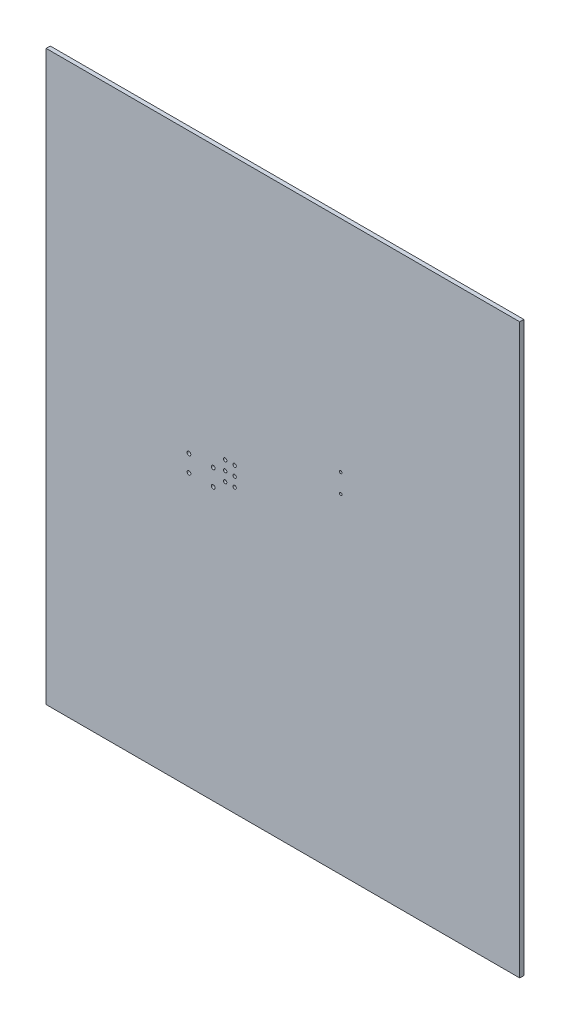
ISO-10303-21;
HEADER;
FILE_DESCRIPTION(('STEP AP214'),'2;1');
FILE_NAME('part.step','',(''),(''),'','','');
FILE_SCHEMA(('AUTOMOTIVE_DESIGN { 1 0 10303 214 1 1 1 1 }'));
ENDSEC;
DATA;
#1=APPLICATION_CONTEXT('core data for automotive mechanical design processes');
#2=APPLICATION_PROTOCOL_DEFINITION('international standard','automotive_design',2000,#1);
#3=PRODUCT_CONTEXT('',#1,'mechanical');
#4=PRODUCT('Part','Part','',(#3));
#5=PRODUCT_RELATED_PRODUCT_CATEGORY('part','',(#4));
#6=PRODUCT_DEFINITION_FORMATION('','',#4);
#7=PRODUCT_DEFINITION_CONTEXT('part definition',#1,'design');
#8=PRODUCT_DEFINITION('design','',#6,#7);
#9=PRODUCT_DEFINITION_SHAPE('','',#8);
#10=(LENGTH_UNIT() NAMED_UNIT(*) SI_UNIT(.MILLI.,.METRE.));
#11=(NAMED_UNIT(*) PLANE_ANGLE_UNIT() SI_UNIT($,.RADIAN.));
#12=(NAMED_UNIT(*) SI_UNIT($,.STERADIAN.) SOLID_ANGLE_UNIT());
#13=UNCERTAINTY_MEASURE_WITH_UNIT(LENGTH_MEASURE(1.E-05),#10,'distance_accuracy_value','');
#14=(GEOMETRIC_REPRESENTATION_CONTEXT(3) GLOBAL_UNCERTAINTY_ASSIGNED_CONTEXT((#13)) GLOBAL_UNIT_ASSIGNED_CONTEXT((#10,
#11,#12)) REPRESENTATION_CONTEXT('',''));
#15=CARTESIAN_POINT('',(0.,0.,0.));
#16=DIRECTION('',(0.,0.,1.));
#17=DIRECTION('',(1.,0.,0.));
#18=AXIS2_PLACEMENT_3D('',#15,#16,#17);
#19=CARTESIAN_POINT('',(25.4,25.4,1.10236));
#20=DIRECTION('',(0.,0.,1.));
#21=DIRECTION('',(1.,0.,0.));
#22=AXIS2_PLACEMENT_3D('',#19,#20,#21);
#23=PLANE('',#22);
#24=CARTESIAN_POINT('',(104.394,118.872,1.10236));
#25=DIRECTION('',(0.,0.,-1.));
#26=DIRECTION('',(-1.,0.,0.));
#27=AXIS2_PLACEMENT_3D('',#24,#25,#26);
#28=CIRCLE('',#27,0.3499993);
#29=CARTESIAN_POINT('',(104.0440007,118.872,1.10236));
#30=VERTEX_POINT('',#29);
#31=EDGE_CURVE('E116',#30,#30,#28,.T.);
#32=ORIENTED_EDGE('',*,*,#31,.T.);
#33=EDGE_LOOP('',(#32));
#34=FACE_BOUND('',#33,.T.);
#35=CARTESIAN_POINT('',(104.394,113.792,1.10236));
#36=DIRECTION('',(0.,0.,-1.));
#37=DIRECTION('',(-1.,0.,0.));
#38=AXIS2_PLACEMENT_3D('',#35,#36,#37);
#39=CIRCLE('',#38,0.3499993);
#40=CARTESIAN_POINT('',(104.0440007,113.792,1.10236));
#41=VERTEX_POINT('',#40);
#42=EDGE_CURVE('E119',#41,#41,#39,.T.);
#43=ORIENTED_EDGE('',*,*,#42,.T.);
#44=EDGE_LOOP('',(#43));
#45=FACE_BOUND('',#44,.T.);
#46=CARTESIAN_POINT('',(75.946,106.25020152,1.10236));
#47=DIRECTION('',(0.,0.,-1.));
#48=DIRECTION('',(-1.,0.,0.));
#49=AXIS2_PLACEMENT_3D('',#46,#47,#48);
#50=CIRCLE('',#49,0.4499991);
#51=CARTESIAN_POINT('',(75.4960009,106.25020152,1.10236));
#52=VERTEX_POINT('',#51);
#53=EDGE_CURVE('E122',#52,#52,#50,.T.);
#54=ORIENTED_EDGE('',*,*,#53,.T.);
#55=EDGE_LOOP('',(#54));
#56=FACE_BOUND('',#55,.T.);
#57=CARTESIAN_POINT('',(75.946,103.71020152,1.10236));
#58=DIRECTION('',(0.,0.,-1.));
#59=DIRECTION('',(-1.,0.,0.));
#60=AXIS2_PLACEMENT_3D('',#57,#58,#59);
#61=CIRCLE('',#60,0.4499991);
#62=CARTESIAN_POINT('',(75.4960009,103.71020152,1.10236));
#63=VERTEX_POINT('',#62);
#64=EDGE_CURVE('E125',#63,#63,#61,.T.);
#65=ORIENTED_EDGE('',*,*,#64,.T.);
#66=EDGE_LOOP('',(#65));
#67=FACE_BOUND('',#66,.T.);
#68=CARTESIAN_POINT('',(75.946,101.17020152,1.10236));
#69=DIRECTION('',(0.,0.,-1.));
#70=DIRECTION('',(-1.,0.,0.));
#71=AXIS2_PLACEMENT_3D('',#68,#69,#70);
#72=CIRCLE('',#71,0.4499991);
#73=CARTESIAN_POINT('',(75.4960009,101.17020152,1.10236));
#74=VERTEX_POINT('',#73);
#75=EDGE_CURVE('E128',#74,#74,#72,.T.);
#76=ORIENTED_EDGE('',*,*,#75,.T.);
#77=EDGE_LOOP('',(#76));
#78=FACE_BOUND('',#77,.T.);
#79=CARTESIAN_POINT('',(73.406,101.17020152,1.10236));
#80=DIRECTION('',(0.,0.,-1.));
#81=DIRECTION('',(-1.,0.,0.));
#82=AXIS2_PLACEMENT_3D('',#79,#80,#81);
#83=CIRCLE('',#82,0.4499991);
#84=CARTESIAN_POINT('',(72.9560009,101.17020152,1.10236));
#85=VERTEX_POINT('',#84);
#86=EDGE_CURVE('E131',#85,#85,#83,.T.);
#87=ORIENTED_EDGE('',*,*,#86,.T.);
#88=EDGE_LOOP('',(#87));
#89=FACE_BOUND('',#88,.T.);
#90=CARTESIAN_POINT('',(73.406,106.25020152,1.10236));
#91=DIRECTION('',(0.,0.,-1.));
#92=DIRECTION('',(-1.,0.,0.));
#93=AXIS2_PLACEMENT_3D('',#90,#91,#92);
#94=CIRCLE('',#93,0.4499991);
#95=CARTESIAN_POINT('',(72.9560009,106.25020152,1.10236));
#96=VERTEX_POINT('',#95);
#97=EDGE_CURVE('E134',#96,#96,#94,.T.);
#98=ORIENTED_EDGE('',*,*,#97,.T.);
#99=EDGE_LOOP('',(#98));
#100=FACE_BOUND('',#99,.T.);
#101=CARTESIAN_POINT('',(73.406,103.71020152,1.10236));
#102=DIRECTION('',(0.,0.,-1.));
#103=DIRECTION('',(-1.,0.,0.));
#104=AXIS2_PLACEMENT_3D('',#101,#102,#103);
#105=CIRCLE('',#104,0.4499991);
#106=CARTESIAN_POINT('',(72.9560009,103.71020152,1.10236));
#107=VERTEX_POINT('',#106);
#108=EDGE_CURVE('E137',#107,#107,#105,.T.);
#109=ORIENTED_EDGE('',*,*,#108,.T.);
#110=EDGE_LOOP('',(#109));
#111=FACE_BOUND('',#110,.T.);
#112=CARTESIAN_POINT('',(70.20440112,102.85940058,1.10236));
#113=DIRECTION('',(0.,0.,-1.));
#114=DIRECTION('',(-1.,0.,0.));
#115=AXIS2_PLACEMENT_3D('',#112,#113,#114);
#116=CIRCLE('',#115,0.499999);
#117=CARTESIAN_POINT('',(69.70440212,102.85940058,1.10236));
#118=VERTEX_POINT('',#117);
#119=EDGE_CURVE('E140',#118,#118,#116,.T.);
#120=ORIENTED_EDGE('',*,*,#119,.T.);
#121=EDGE_LOOP('',(#120));
#122=FACE_BOUND('',#121,.T.);
#123=CARTESIAN_POINT('',(63.70439888,98.35939942,1.10236));
#124=DIRECTION('',(0.,0.,-1.));
#125=DIRECTION('',(-1.,0.,0.));
#126=AXIS2_PLACEMENT_3D('',#123,#124,#125);
#127=CIRCLE('',#126,0.499999);
#128=CARTESIAN_POINT('',(63.20439988,98.35939942,1.10236));
#129=VERTEX_POINT('',#128);
#130=EDGE_CURVE('E143',#129,#129,#127,.T.);
#131=ORIENTED_EDGE('',*,*,#130,.T.);
#132=EDGE_LOOP('',(#131));
#133=FACE_BOUND('',#132,.T.);
#134=CARTESIAN_POINT('',(70.20440112,98.35939942,1.10236));
#135=DIRECTION('',(0.,0.,-1.));
#136=DIRECTION('',(-1.,0.,0.));
#137=AXIS2_PLACEMENT_3D('',#134,#135,#136);
#138=CIRCLE('',#137,0.499999);
#139=CARTESIAN_POINT('',(69.70440212,98.35939942,1.10236));
#140=VERTEX_POINT('',#139);
#141=EDGE_CURVE('E145',#140,#140,#138,.T.);
#142=ORIENTED_EDGE('',*,*,#141,.T.);
#143=EDGE_LOOP('',(#142));
#144=FACE_BOUND('',#143,.T.);
#145=CARTESIAN_POINT('',(63.70439888,102.85940058,1.10236));
#146=DIRECTION('',(0.,0.,-1.));
#147=DIRECTION('',(-1.,0.,0.));
#148=AXIS2_PLACEMENT_3D('',#145,#146,#147);
#149=CIRCLE('',#148,0.499999);
#150=CARTESIAN_POINT('',(63.20439988,102.85940058,1.10236));
#151=VERTEX_POINT('',#150);
#152=EDGE_CURVE('E20',#151,#151,#149,.T.);
#153=ORIENTED_EDGE('',*,*,#152,.T.);
#154=EDGE_LOOP('',(#153));
#155=FACE_BOUND('',#154,.T.);
#156=DIRECTION('',(1.,0.,0.));
#157=VECTOR('',#156,1.);
#158=CARTESIAN_POINT('',(25.4,177.8,1.10236));
#159=LINE('',#158,#157);
#160=CARTESIAN_POINT('',(25.4,177.8,1.10236));
#161=VERTEX_POINT('',#160);
#162=CARTESIAN_POINT('',(152.4,177.8,1.10236));
#163=VERTEX_POINT('',#162);
#164=EDGE_CURVE('E54',#161,#163,#159,.T.);
#165=ORIENTED_EDGE('',*,*,#164,.F.);
#166=DIRECTION('',(0.,1.,0.));
#167=VECTOR('',#166,1.);
#168=CARTESIAN_POINT('',(25.4,25.4,1.10236));
#169=LINE('',#168,#167);
#170=CARTESIAN_POINT('',(25.4,25.4,1.10236));
#171=VERTEX_POINT('',#170);
#172=EDGE_CURVE('E71',#171,#161,#169,.T.);
#173=ORIENTED_EDGE('',*,*,#172,.F.);
#174=DIRECTION('',(1.,0.,0.));
#175=VECTOR('',#174,1.);
#176=CARTESIAN_POINT('',(152.4,25.4,1.10236));
#177=LINE('',#176,#175);
#178=CARTESIAN_POINT('',(152.4,25.4,1.10236));
#179=VERTEX_POINT('',#178);
#180=EDGE_CURVE('E68',#179,#171,#177,.F.);
#181=ORIENTED_EDGE('',*,*,#180,.F.);
#182=DIRECTION('',(0.,1.,0.));
#183=VECTOR('',#182,1.);
#184=CARTESIAN_POINT('',(152.4,177.8,1.10236));
#185=LINE('',#184,#183);
#186=EDGE_CURVE('E59',#163,#179,#185,.F.);
#187=ORIENTED_EDGE('',*,*,#186,.F.);
#188=EDGE_LOOP('',(#165,#173,#181,#187));
#189=FACE_BOUND('',#188,.T.);
#190=ADVANCED_FACE('F17',(#34,#45,#56,#67,#78,#89,#100,#111,#122,#133,#144,#155,#189),#23,.T.);
#191=CARTESIAN_POINT('',(152.4,25.4,0.));
#192=DIRECTION('',(0.,-1.,0.));
#193=DIRECTION('',(0.,0.,-1.));
#194=AXIS2_PLACEMENT_3D('',#191,#192,#193);
#195=PLANE('',#194);
#196=DIRECTION('',(0.,0.,1.));
#197=VECTOR('',#196,1.);
#198=CARTESIAN_POINT('',(25.4,25.4,0.));
#199=LINE('',#198,#197);
#200=CARTESIAN_POINT('',(25.4,25.4,0.));
#201=VERTEX_POINT('',#200);
#202=EDGE_CURVE('E153',#201,#171,#199,.T.);
#203=ORIENTED_EDGE('',*,*,#202,.F.);
#204=DIRECTION('',(1.,0.,0.));
#205=VECTOR('',#204,1.);
#206=CARTESIAN_POINT('',(25.4,25.4,0.));
#207=LINE('',#206,#205);
#208=CARTESIAN_POINT('',(152.4,25.4,0.));
#209=VERTEX_POINT('',#208);
#210=EDGE_CURVE('E78',#201,#209,#207,.T.);
#211=ORIENTED_EDGE('',*,*,#210,.T.);
#212=DIRECTION('',(0.,0.,-1.));
#213=VECTOR('',#212,1.);
#214=CARTESIAN_POINT('',(152.4,25.4,0.));
#215=LINE('',#214,#213);
#216=EDGE_CURVE('E64',#179,#209,#215,.T.);
#217=ORIENTED_EDGE('',*,*,#216,.F.);
#218=ORIENTED_EDGE('',*,*,#180,.T.);
#219=EDGE_LOOP('',(#203,#211,#217,#218));
#220=FACE_BOUND('',#219,.T.);
#221=ADVANCED_FACE('F77',(#220),#195,.T.);
#222=CARTESIAN_POINT('',(152.4,177.8,0.));
#223=DIRECTION('',(1.,0.,0.));
#224=DIRECTION('',(0.,0.,-1.));
#225=AXIS2_PLACEMENT_3D('',#222,#223,#224);
#226=PLANE('',#225);
#227=ORIENTED_EDGE('',*,*,#216,.T.);
#228=DIRECTION('',(0.,1.,0.));
#229=VECTOR('',#228,1.);
#230=CARTESIAN_POINT('',(152.4,25.4,0.));
#231=LINE('',#230,#229);
#232=CARTESIAN_POINT('',(152.4,177.8,0.));
#233=VERTEX_POINT('',#232);
#234=EDGE_CURVE('E164',#209,#233,#231,.T.);
#235=ORIENTED_EDGE('',*,*,#234,.T.);
#236=DIRECTION('',(0.,0.,1.));
#237=VECTOR('',#236,1.);
#238=CARTESIAN_POINT('',(152.4,177.8,0.));
#239=LINE('',#238,#237);
#240=EDGE_CURVE('E66',#163,#233,#239,.F.);
#241=ORIENTED_EDGE('',*,*,#240,.F.);
#242=ORIENTED_EDGE('',*,*,#186,.T.);
#243=EDGE_LOOP('',(#227,#235,#241,#242));
#244=FACE_BOUND('',#243,.T.);
#245=ADVANCED_FACE('F61',(#244),#226,.T.);
#246=CARTESIAN_POINT('',(25.4,177.8,0.));
#247=DIRECTION('',(0.,1.,0.));
#248=DIRECTION('',(0.,0.,1.));
#249=AXIS2_PLACEMENT_3D('',#246,#247,#248);
#250=PLANE('',#249);
#251=ORIENTED_EDGE('',*,*,#240,.T.);
#252=DIRECTION('',(1.,0.,0.));
#253=VECTOR('',#252,1.);
#254=CARTESIAN_POINT('',(25.4,177.8,0.));
#255=LINE('',#254,#253);
#256=CARTESIAN_POINT('',(25.4,177.8,0.));
#257=VERTEX_POINT('',#256);
#258=EDGE_CURVE('E161',#233,#257,#255,.F.);
#259=ORIENTED_EDGE('',*,*,#258,.T.);
#260=DIRECTION('',(0.,0.,1.));
#261=VECTOR('',#260,1.);
#262=CARTESIAN_POINT('',(25.4,177.8,0.));
#263=LINE('',#262,#261);
#264=EDGE_CURVE('E35',#161,#257,#263,.F.);
#265=ORIENTED_EDGE('',*,*,#264,.F.);
#266=ORIENTED_EDGE('',*,*,#164,.T.);
#267=EDGE_LOOP('',(#251,#259,#265,#266));
#268=FACE_BOUND('',#267,.T.);
#269=ADVANCED_FACE('F160',(#268),#250,.T.);
#270=CARTESIAN_POINT('',(25.4,25.4,0.));
#271=DIRECTION('',(-1.,0.,0.));
#272=DIRECTION('',(0.,0.,1.));
#273=AXIS2_PLACEMENT_3D('',#270,#271,#272);
#274=PLANE('',#273);
#275=ORIENTED_EDGE('',*,*,#264,.T.);
#276=DIRECTION('',(0.,1.,0.));
#277=VECTOR('',#276,1.);
#278=CARTESIAN_POINT('',(25.4,25.4,0.));
#279=LINE('',#278,#277);
#280=EDGE_CURVE('E115',#257,#201,#279,.F.);
#281=ORIENTED_EDGE('',*,*,#280,.T.);
#282=ORIENTED_EDGE('',*,*,#202,.T.);
#283=ORIENTED_EDGE('',*,*,#172,.T.);
#284=EDGE_LOOP('',(#275,#281,#282,#283));
#285=FACE_BOUND('',#284,.T.);
#286=ADVANCED_FACE('F167',(#285),#274,.T.);
#287=CARTESIAN_POINT('',(63.70439888,102.85940058,0.));
#288=DIRECTION('',(0.,0.,-1.));
#289=DIRECTION('',(-1.,0.,0.));
#290=AXIS2_PLACEMENT_3D('',#287,#288,#289);
#291=CYLINDRICAL_SURFACE('',#290,0.499999);
#292=ORIENTED_EDGE('',*,*,#152,.F.);
#293=EDGE_LOOP('',(#292));
#294=FACE_BOUND('',#293,.T.);
#295=CARTESIAN_POINT('',(63.70439888,102.85940058,0.));
#296=DIRECTION('',(0.,0.,-1.));
#297=DIRECTION('',(-1.,0.,0.));
#298=AXIS2_PLACEMENT_3D('',#295,#296,#297);
#299=CIRCLE('',#298,0.499999);
#300=CARTESIAN_POINT('',(63.20439988,102.85940058,0.));
#301=VERTEX_POINT('',#300);
#302=EDGE_CURVE('E112',#301,#301,#299,.F.);
#303=ORIENTED_EDGE('',*,*,#302,.F.);
#304=EDGE_LOOP('',(#303));
#305=FACE_BOUND('',#304,.T.);
#306=ADVANCED_FACE('F169',(#294,#305),#291,.F.);
#307=CARTESIAN_POINT('',(70.20440112,98.35939942,0.));
#308=DIRECTION('',(0.,0.,-1.));
#309=DIRECTION('',(-1.,0.,0.));
#310=AXIS2_PLACEMENT_3D('',#307,#308,#309);
#311=CYLINDRICAL_SURFACE('',#310,0.499999);
#312=ORIENTED_EDGE('',*,*,#141,.F.);
#313=EDGE_LOOP('',(#312));
#314=FACE_BOUND('',#313,.T.);
#315=CARTESIAN_POINT('',(70.20440112,98.35939942,0.));
#316=DIRECTION('',(0.,0.,-1.));
#317=DIRECTION('',(-1.,0.,0.));
#318=AXIS2_PLACEMENT_3D('',#315,#316,#317);
#319=CIRCLE('',#318,0.499999);
#320=CARTESIAN_POINT('',(69.70440212,98.35939942,0.));
#321=VERTEX_POINT('',#320);
#322=EDGE_CURVE('E109',#321,#321,#319,.F.);
#323=ORIENTED_EDGE('',*,*,#322,.F.);
#324=EDGE_LOOP('',(#323));
#325=FACE_BOUND('',#324,.T.);
#326=ADVANCED_FACE('F176',(#314,#325),#311,.F.);
#327=CARTESIAN_POINT('',(63.70439888,98.35939942,0.));
#328=DIRECTION('',(0.,0.,-1.));
#329=DIRECTION('',(-1.,0.,0.));
#330=AXIS2_PLACEMENT_3D('',#327,#328,#329);
#331=CYLINDRICAL_SURFACE('',#330,0.499999);
#332=ORIENTED_EDGE('',*,*,#130,.F.);
#333=EDGE_LOOP('',(#332));
#334=FACE_BOUND('',#333,.T.);
#335=CARTESIAN_POINT('',(63.70439888,98.35939942,0.));
#336=DIRECTION('',(0.,0.,-1.));
#337=DIRECTION('',(-1.,0.,0.));
#338=AXIS2_PLACEMENT_3D('',#335,#336,#337);
#339=CIRCLE('',#338,0.499999);
#340=CARTESIAN_POINT('',(63.20439988,98.35939942,0.));
#341=VERTEX_POINT('',#340);
#342=EDGE_CURVE('E106',#341,#341,#339,.F.);
#343=ORIENTED_EDGE('',*,*,#342,.F.);
#344=EDGE_LOOP('',(#343));
#345=FACE_BOUND('',#344,.T.);
#346=ADVANCED_FACE('F222',(#334,#345),#331,.F.);
#347=CARTESIAN_POINT('',(70.20440112,102.85940058,0.));
#348=DIRECTION('',(0.,0.,-1.));
#349=DIRECTION('',(-1.,0.,0.));
#350=AXIS2_PLACEMENT_3D('',#347,#348,#349);
#351=CYLINDRICAL_SURFACE('',#350,0.499999);
#352=ORIENTED_EDGE('',*,*,#119,.F.);
#353=EDGE_LOOP('',(#352));
#354=FACE_BOUND('',#353,.T.);
#355=CARTESIAN_POINT('',(70.20440112,102.85940058,0.));
#356=DIRECTION('',(0.,0.,-1.));
#357=DIRECTION('',(-1.,0.,0.));
#358=AXIS2_PLACEMENT_3D('',#355,#356,#357);
#359=CIRCLE('',#358,0.499999);
#360=CARTESIAN_POINT('',(69.70440212,102.85940058,0.));
#361=VERTEX_POINT('',#360);
#362=EDGE_CURVE('E103',#361,#361,#359,.F.);
#363=ORIENTED_EDGE('',*,*,#362,.F.);
#364=EDGE_LOOP('',(#363));
#365=FACE_BOUND('',#364,.T.);
#366=ADVANCED_FACE('F218',(#354,#365),#351,.F.);
#367=CARTESIAN_POINT('',(73.406,103.71020152,0.));
#368=DIRECTION('',(0.,0.,-1.));
#369=DIRECTION('',(-1.,0.,0.));
#370=AXIS2_PLACEMENT_3D('',#367,#368,#369);
#371=CYLINDRICAL_SURFACE('',#370,0.4499991);
#372=ORIENTED_EDGE('',*,*,#108,.F.);
#373=EDGE_LOOP('',(#372));
#374=FACE_BOUND('',#373,.T.);
#375=CARTESIAN_POINT('',(73.406,103.71020152,0.));
#376=DIRECTION('',(0.,0.,-1.));
#377=DIRECTION('',(-1.,0.,0.));
#378=AXIS2_PLACEMENT_3D('',#375,#376,#377);
#379=CIRCLE('',#378,0.4499991);
#380=CARTESIAN_POINT('',(72.9560009,103.71020152,0.));
#381=VERTEX_POINT('',#380);
#382=EDGE_CURVE('E100',#381,#381,#379,.F.);
#383=ORIENTED_EDGE('',*,*,#382,.F.);
#384=EDGE_LOOP('',(#383));
#385=FACE_BOUND('',#384,.T.);
#386=ADVANCED_FACE('F214',(#374,#385),#371,.F.);
#387=CARTESIAN_POINT('',(73.406,106.25020152,0.));
#388=DIRECTION('',(0.,0.,-1.));
#389=DIRECTION('',(-1.,0.,0.));
#390=AXIS2_PLACEMENT_3D('',#387,#388,#389);
#391=CYLINDRICAL_SURFACE('',#390,0.4499991);
#392=ORIENTED_EDGE('',*,*,#97,.F.);
#393=EDGE_LOOP('',(#392));
#394=FACE_BOUND('',#393,.T.);
#395=CARTESIAN_POINT('',(73.406,106.25020152,0.));
#396=DIRECTION('',(0.,0.,-1.));
#397=DIRECTION('',(-1.,0.,0.));
#398=AXIS2_PLACEMENT_3D('',#395,#396,#397);
#399=CIRCLE('',#398,0.4499991);
#400=CARTESIAN_POINT('',(72.9560009,106.25020152,0.));
#401=VERTEX_POINT('',#400);
#402=EDGE_CURVE('E97',#401,#401,#399,.F.);
#403=ORIENTED_EDGE('',*,*,#402,.F.);
#404=EDGE_LOOP('',(#403));
#405=FACE_BOUND('',#404,.T.);
#406=ADVANCED_FACE('F210',(#394,#405),#391,.F.);
#407=CARTESIAN_POINT('',(73.406,101.17020152,0.));
#408=DIRECTION('',(0.,0.,-1.));
#409=DIRECTION('',(-1.,0.,0.));
#410=AXIS2_PLACEMENT_3D('',#407,#408,#409);
#411=CYLINDRICAL_SURFACE('',#410,0.4499991);
#412=ORIENTED_EDGE('',*,*,#86,.F.);
#413=EDGE_LOOP('',(#412));
#414=FACE_BOUND('',#413,.T.);
#415=CARTESIAN_POINT('',(73.406,101.17020152,0.));
#416=DIRECTION('',(0.,0.,-1.));
#417=DIRECTION('',(-1.,0.,0.));
#418=AXIS2_PLACEMENT_3D('',#415,#416,#417);
#419=CIRCLE('',#418,0.4499991);
#420=CARTESIAN_POINT('',(72.9560009,101.17020152,0.));
#421=VERTEX_POINT('',#420);
#422=EDGE_CURVE('E94',#421,#421,#419,.F.);
#423=ORIENTED_EDGE('',*,*,#422,.F.);
#424=EDGE_LOOP('',(#423));
#425=FACE_BOUND('',#424,.T.);
#426=ADVANCED_FACE('F206',(#414,#425),#411,.F.);
#427=CARTESIAN_POINT('',(75.946,101.17020152,0.));
#428=DIRECTION('',(0.,0.,-1.));
#429=DIRECTION('',(-1.,0.,0.));
#430=AXIS2_PLACEMENT_3D('',#427,#428,#429);
#431=CYLINDRICAL_SURFACE('',#430,0.4499991);
#432=ORIENTED_EDGE('',*,*,#75,.F.);
#433=EDGE_LOOP('',(#432));
#434=FACE_BOUND('',#433,.T.);
#435=CARTESIAN_POINT('',(75.946,101.17020152,0.));
#436=DIRECTION('',(0.,0.,-1.));
#437=DIRECTION('',(-1.,0.,0.));
#438=AXIS2_PLACEMENT_3D('',#435,#436,#437);
#439=CIRCLE('',#438,0.4499991);
#440=CARTESIAN_POINT('',(75.4960009,101.17020152,0.));
#441=VERTEX_POINT('',#440);
#442=EDGE_CURVE('E91',#441,#441,#439,.F.);
#443=ORIENTED_EDGE('',*,*,#442,.F.);
#444=EDGE_LOOP('',(#443));
#445=FACE_BOUND('',#444,.T.);
#446=ADVANCED_FACE('F202',(#434,#445),#431,.F.);
#447=CARTESIAN_POINT('',(75.946,103.71020152,0.));
#448=DIRECTION('',(0.,0.,-1.));
#449=DIRECTION('',(-1.,0.,0.));
#450=AXIS2_PLACEMENT_3D('',#447,#448,#449);
#451=CYLINDRICAL_SURFACE('',#450,0.4499991);
#452=ORIENTED_EDGE('',*,*,#64,.F.);
#453=EDGE_LOOP('',(#452));
#454=FACE_BOUND('',#453,.T.);
#455=CARTESIAN_POINT('',(75.946,103.71020152,0.));
#456=DIRECTION('',(0.,0.,-1.));
#457=DIRECTION('',(-1.,0.,0.));
#458=AXIS2_PLACEMENT_3D('',#455,#456,#457);
#459=CIRCLE('',#458,0.4499991);
#460=CARTESIAN_POINT('',(75.4960009,103.71020152,0.));
#461=VERTEX_POINT('',#460);
#462=EDGE_CURVE('E88',#461,#461,#459,.F.);
#463=ORIENTED_EDGE('',*,*,#462,.F.);
#464=EDGE_LOOP('',(#463));
#465=FACE_BOUND('',#464,.T.);
#466=ADVANCED_FACE('F198',(#454,#465),#451,.F.);
#467=CARTESIAN_POINT('',(75.946,106.25020152,0.));
#468=DIRECTION('',(0.,0.,-1.));
#469=DIRECTION('',(-1.,0.,0.));
#470=AXIS2_PLACEMENT_3D('',#467,#468,#469);
#471=CYLINDRICAL_SURFACE('',#470,0.4499991);
#472=ORIENTED_EDGE('',*,*,#53,.F.);
#473=EDGE_LOOP('',(#472));
#474=FACE_BOUND('',#473,.T.);
#475=CARTESIAN_POINT('',(75.946,106.25020152,0.));
#476=DIRECTION('',(0.,0.,-1.));
#477=DIRECTION('',(-1.,0.,0.));
#478=AXIS2_PLACEMENT_3D('',#475,#476,#477);
#479=CIRCLE('',#478,0.4499991);
#480=CARTESIAN_POINT('',(75.4960009,106.25020152,0.));
#481=VERTEX_POINT('',#480);
#482=EDGE_CURVE('E85',#481,#481,#479,.F.);
#483=ORIENTED_EDGE('',*,*,#482,.F.);
#484=EDGE_LOOP('',(#483));
#485=FACE_BOUND('',#484,.T.);
#486=ADVANCED_FACE('F194',(#474,#485),#471,.F.);
#487=CARTESIAN_POINT('',(104.394,113.792,0.));
#488=DIRECTION('',(0.,0.,-1.));
#489=DIRECTION('',(-1.,0.,0.));
#490=AXIS2_PLACEMENT_3D('',#487,#488,#489);
#491=CYLINDRICAL_SURFACE('',#490,0.3499993);
#492=ORIENTED_EDGE('',*,*,#42,.F.);
#493=EDGE_LOOP('',(#492));
#494=FACE_BOUND('',#493,.T.);
#495=CARTESIAN_POINT('',(104.394,113.792,0.));
#496=DIRECTION('',(0.,0.,-1.));
#497=DIRECTION('',(-1.,0.,0.));
#498=AXIS2_PLACEMENT_3D('',#495,#496,#497);
#499=CIRCLE('',#498,0.3499993);
#500=CARTESIAN_POINT('',(104.0440007,113.792,0.));
#501=VERTEX_POINT('',#500);
#502=EDGE_CURVE('E26',#501,#501,#499,.F.);
#503=ORIENTED_EDGE('',*,*,#502,.F.);
#504=EDGE_LOOP('',(#503));
#505=FACE_BOUND('',#504,.T.);
#506=ADVANCED_FACE('F187',(#494,#505),#491,.F.);
#507=CARTESIAN_POINT('',(104.394,118.872,0.));
#508=DIRECTION('',(0.,0.,-1.));
#509=DIRECTION('',(-1.,0.,0.));
#510=AXIS2_PLACEMENT_3D('',#507,#508,#509);
#511=CYLINDRICAL_SURFACE('',#510,0.3499993);
#512=ORIENTED_EDGE('',*,*,#31,.F.);
#513=EDGE_LOOP('',(#512));
#514=FACE_BOUND('',#513,.T.);
#515=CARTESIAN_POINT('',(104.394,118.872,0.));
#516=DIRECTION('',(0.,0.,-1.));
#517=DIRECTION('',(-1.,0.,0.));
#518=AXIS2_PLACEMENT_3D('',#515,#516,#517);
#519=CIRCLE('',#518,0.3499993);
#520=CARTESIAN_POINT('',(104.0440007,118.872,0.));
#521=VERTEX_POINT('',#520);
#522=EDGE_CURVE('E11',#521,#521,#519,.F.);
#523=ORIENTED_EDGE('',*,*,#522,.F.);
#524=EDGE_LOOP('',(#523));
#525=FACE_BOUND('',#524,.T.);
#526=ADVANCED_FACE('F181',(#514,#525),#511,.F.);
#527=CARTESIAN_POINT('',(25.4,25.4,0.));
#528=DIRECTION('',(0.,0.,1.));
#529=DIRECTION('',(1.,0.,0.));
#530=AXIS2_PLACEMENT_3D('',#527,#528,#529);
#531=PLANE('',#530);
#532=ORIENTED_EDGE('',*,*,#522,.T.);
#533=EDGE_LOOP('',(#532));
#534=FACE_BOUND('',#533,.T.);
#535=ORIENTED_EDGE('',*,*,#502,.T.);
#536=EDGE_LOOP('',(#535));
#537=FACE_BOUND('',#536,.T.);
#538=ORIENTED_EDGE('',*,*,#482,.T.);
#539=EDGE_LOOP('',(#538));
#540=FACE_BOUND('',#539,.T.);
#541=ORIENTED_EDGE('',*,*,#462,.T.);
#542=EDGE_LOOP('',(#541));
#543=FACE_BOUND('',#542,.T.);
#544=ORIENTED_EDGE('',*,*,#442,.T.);
#545=EDGE_LOOP('',(#544));
#546=FACE_BOUND('',#545,.T.);
#547=ORIENTED_EDGE('',*,*,#422,.T.);
#548=EDGE_LOOP('',(#547));
#549=FACE_BOUND('',#548,.T.);
#550=ORIENTED_EDGE('',*,*,#402,.T.);
#551=EDGE_LOOP('',(#550));
#552=FACE_BOUND('',#551,.T.);
#553=ORIENTED_EDGE('',*,*,#382,.T.);
#554=EDGE_LOOP('',(#553));
#555=FACE_BOUND('',#554,.T.);
#556=ORIENTED_EDGE('',*,*,#362,.T.);
#557=EDGE_LOOP('',(#556));
#558=FACE_BOUND('',#557,.T.);
#559=ORIENTED_EDGE('',*,*,#342,.T.);
#560=EDGE_LOOP('',(#559));
#561=FACE_BOUND('',#560,.T.);
#562=ORIENTED_EDGE('',*,*,#322,.T.);
#563=EDGE_LOOP('',(#562));
#564=FACE_BOUND('',#563,.T.);
#565=ORIENTED_EDGE('',*,*,#302,.T.);
#566=EDGE_LOOP('',(#565));
#567=FACE_BOUND('',#566,.T.);
#568=ORIENTED_EDGE('',*,*,#258,.F.);
#569=ORIENTED_EDGE('',*,*,#234,.F.);
#570=ORIENTED_EDGE('',*,*,#210,.F.);
#571=ORIENTED_EDGE('',*,*,#280,.F.);
#572=EDGE_LOOP('',(#568,#569,#570,#571));
#573=FACE_BOUND('',#572,.T.);
#574=ADVANCED_FACE('F163',(#534,#537,#540,#543,#546,#549,#552,#555,#558,#561,#564,#567,#573),
#531,.F.);
#575=CLOSED_SHELL('',(#190,#221,#245,#269,#286,#306,#326,#346,#366,#386,#406,#426,#446,#466,
#486,#506,#526,#574));
#576=MANIFOLD_SOLID_BREP('B1',#575);
#577=ADVANCED_BREP_SHAPE_REPRESENTATION('',(#18,#576),#14);
#578=SHAPE_DEFINITION_REPRESENTATION(#9,#577);
ENDSEC;
END-ISO-10303-21;
